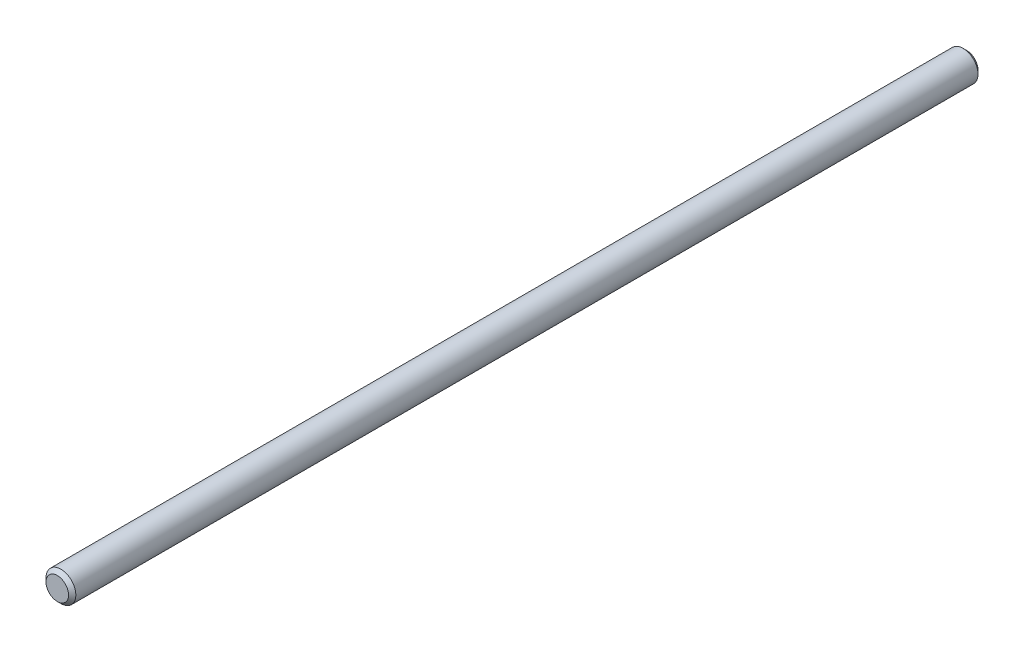
ISO-10303-21;
HEADER;
FILE_DESCRIPTION(('STEP AP214'),'2;1');
FILE_NAME('part.step','',(''),(''),'','','');
FILE_SCHEMA(('AUTOMOTIVE_DESIGN { 1 0 10303 214 1 1 1 1 }'));
ENDSEC;
DATA;
#1=APPLICATION_CONTEXT('core data for automotive mechanical design processes');
#2=APPLICATION_PROTOCOL_DEFINITION('international standard','automotive_design',2000,#1);
#3=PRODUCT_CONTEXT('',#1,'mechanical');
#4=PRODUCT('Part','Part','',(#3));
#5=PRODUCT_RELATED_PRODUCT_CATEGORY('part','',(#4));
#6=PRODUCT_DEFINITION_FORMATION('','',#4);
#7=PRODUCT_DEFINITION_CONTEXT('part definition',#1,'design');
#8=PRODUCT_DEFINITION('design','',#6,#7);
#9=PRODUCT_DEFINITION_SHAPE('','',#8);
#10=(LENGTH_UNIT() NAMED_UNIT(*) SI_UNIT(.MILLI.,.METRE.));
#11=(NAMED_UNIT(*) PLANE_ANGLE_UNIT() SI_UNIT($,.RADIAN.));
#12=(NAMED_UNIT(*) SI_UNIT($,.STERADIAN.) SOLID_ANGLE_UNIT());
#13=UNCERTAINTY_MEASURE_WITH_UNIT(LENGTH_MEASURE(1.E-05),#10,'distance_accuracy_value','');
#14=(GEOMETRIC_REPRESENTATION_CONTEXT(3) GLOBAL_UNCERTAINTY_ASSIGNED_CONTEXT((#13)) GLOBAL_UNIT_ASSIGNED_CONTEXT((#10,
#11,#12)) REPRESENTATION_CONTEXT('',''));
#15=CARTESIAN_POINT('',(0.,0.,0.));
#16=DIRECTION('',(0.,0.,1.));
#17=DIRECTION('',(1.,0.,0.));
#18=AXIS2_PLACEMENT_3D('',#15,#16,#17);
#19=CARTESIAN_POINT('',(0.,0.,250.));
#20=DIRECTION('',(0.,0.,-1.));
#21=DIRECTION('',(-1.,0.,0.));
#22=AXIS2_PLACEMENT_3D('',#19,#20,#21);
#23=CYLINDRICAL_SURFACE('',#22,4.1);
#24=CARTESIAN_POINT('',(0.,0.,1.00000000000006));
#25=DIRECTION('',(0.,0.,1.));
#26=DIRECTION('',(1.,0.,0.));
#27=AXIS2_PLACEMENT_3D('',#24,#25,#26);
#28=CIRCLE('',#27,4.1);
#29=CARTESIAN_POINT('',(4.1,0.,1.00000000000006));
#30=VERTEX_POINT('',#29);
#31=EDGE_CURVE('E42',#30,#30,#28,.T.);
#32=ORIENTED_EDGE('',*,*,#31,.T.);
#33=EDGE_LOOP('',(#32));
#34=FACE_BOUND('',#33,.T.);
#35=CARTESIAN_POINT('',(0.,0.,249.));
#36=DIRECTION('',(0.,0.,1.));
#37=DIRECTION('',(1.,0.,0.));
#38=AXIS2_PLACEMENT_3D('',#35,#36,#37);
#39=CIRCLE('',#38,4.1);
#40=CARTESIAN_POINT('',(4.1,0.,249.));
#41=VERTEX_POINT('',#40);
#42=EDGE_CURVE('E46',#41,#41,#39,.F.);
#43=ORIENTED_EDGE('',*,*,#42,.T.);
#44=EDGE_LOOP('',(#43));
#45=FACE_BOUND('',#44,.T.);
#46=ADVANCED_FACE('F31',(#34,#45),#23,.T.);
#47=CARTESIAN_POINT('',(0.,0.,250.));
#48=DIRECTION('',(0.,0.,1.));
#49=DIRECTION('',(1.,0.,0.));
#50=AXIS2_PLACEMENT_3D('',#47,#48,#49);
#51=PLANE('',#50);
#52=CARTESIAN_POINT('',(0.,0.,250.));
#53=DIRECTION('',(0.,0.,1.));
#54=DIRECTION('',(1.,0.,0.));
#55=AXIS2_PLACEMENT_3D('',#52,#53,#54);
#56=CIRCLE('',#55,3.09999999999996);
#57=CARTESIAN_POINT('',(3.09999999999996,0.,250.));
#58=VERTEX_POINT('',#57);
#59=EDGE_CURVE('E10',#58,#58,#56,.T.);
#60=ORIENTED_EDGE('',*,*,#59,.T.);
#61=EDGE_LOOP('',(#60));
#62=FACE_BOUND('',#61,.T.);
#63=ADVANCED_FACE('F62',(#62),#51,.T.);
#64=CARTESIAN_POINT('',(0.,0.,0.));
#65=DIRECTION('',(0.,0.,1.));
#66=DIRECTION('',(1.,0.,0.));
#67=AXIS2_PLACEMENT_3D('',#64,#65,#66);
#68=PLANE('',#67);
#69=CARTESIAN_POINT('',(0.,0.,0.));
#70=DIRECTION('',(0.,0.,1.));
#71=DIRECTION('',(1.,0.,0.));
#72=AXIS2_PLACEMENT_3D('',#69,#70,#71);
#73=CIRCLE('',#72,3.09999999999996);
#74=CARTESIAN_POINT('',(3.09999999999996,0.,0.));
#75=VERTEX_POINT('',#74);
#76=EDGE_CURVE('E38',#75,#75,#73,.F.);
#77=ORIENTED_EDGE('',*,*,#76,.T.);
#78=EDGE_LOOP('',(#77));
#79=FACE_BOUND('',#78,.T.);
#80=ADVANCED_FACE('F59',(#79),#68,.F.);
#81=CARTESIAN_POINT('',(0.,0.,1.00000000000006));
#82=DIRECTION('',(0.,0.,1.));
#83=DIRECTION('',(1.,0.,0.));
#84=AXIS2_PLACEMENT_3D('',#81,#82,#83);
#85=CONICAL_SURFACE('',#84,4.1,0.785398163397438);
#86=ORIENTED_EDGE('',*,*,#76,.F.);
#87=EDGE_LOOP('',(#86));
#88=FACE_BOUND('',#87,.T.);
#89=ORIENTED_EDGE('',*,*,#31,.F.);
#90=EDGE_LOOP('',(#89));
#91=FACE_BOUND('',#90,.T.);
#92=ADVANCED_FACE('F55',(#88,#91),#85,.T.);
#93=CARTESIAN_POINT('',(0.,0.,250.));
#94=DIRECTION('',(0.,0.,-1.));
#95=DIRECTION('',(-1.,0.,0.));
#96=AXIS2_PLACEMENT_3D('',#93,#94,#95);
#97=CONICAL_SURFACE('',#96,3.09999999999996,0.785398163397452);
#98=ORIENTED_EDGE('',*,*,#42,.F.);
#99=EDGE_LOOP('',(#98));
#100=FACE_BOUND('',#99,.T.);
#101=ORIENTED_EDGE('',*,*,#59,.F.);
#102=EDGE_LOOP('',(#101));
#103=FACE_BOUND('',#102,.T.);
#104=ADVANCED_FACE('F33',(#100,#103),#97,.T.);
#105=CLOSED_SHELL('',(#46,#63,#80,#92,#104));
#106=MANIFOLD_SOLID_BREP('B2',#105);
#107=ADVANCED_BREP_SHAPE_REPRESENTATION('',(#18,#106),#14);
#108=SHAPE_DEFINITION_REPRESENTATION(#9,#107);
ENDSEC;
END-ISO-10303-21;
